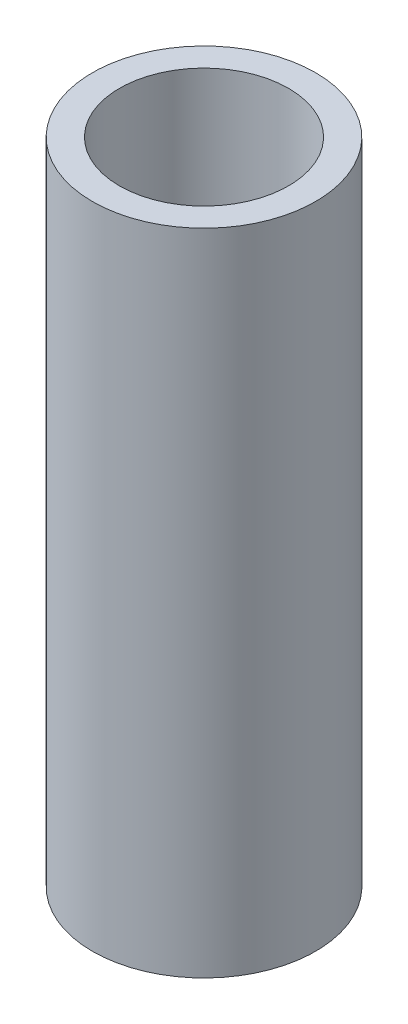
ISO-10303-21;
HEADER;
FILE_DESCRIPTION(('STEP AP214'),'2;1');
FILE_NAME('part.step','',(''),(''),'','','');
FILE_SCHEMA(('AUTOMOTIVE_DESIGN { 1 0 10303 214 1 1 1 1 }'));
ENDSEC;
DATA;
#1=APPLICATION_CONTEXT('core data for automotive mechanical design processes');
#2=APPLICATION_PROTOCOL_DEFINITION('international standard','automotive_design',2000,#1);
#3=PRODUCT_CONTEXT('',#1,'mechanical');
#4=PRODUCT('Part','Part','',(#3));
#5=PRODUCT_RELATED_PRODUCT_CATEGORY('part','',(#4));
#6=PRODUCT_DEFINITION_FORMATION('','',#4);
#7=PRODUCT_DEFINITION_CONTEXT('part definition',#1,'design');
#8=PRODUCT_DEFINITION('design','',#6,#7);
#9=PRODUCT_DEFINITION_SHAPE('','',#8);
#10=(LENGTH_UNIT() NAMED_UNIT(*) SI_UNIT(.MILLI.,.METRE.));
#11=(NAMED_UNIT(*) PLANE_ANGLE_UNIT() SI_UNIT($,.RADIAN.));
#12=(NAMED_UNIT(*) SI_UNIT($,.STERADIAN.) SOLID_ANGLE_UNIT());
#13=UNCERTAINTY_MEASURE_WITH_UNIT(LENGTH_MEASURE(1.E-05),#10,'distance_accuracy_value','');
#14=(GEOMETRIC_REPRESENTATION_CONTEXT(3) GLOBAL_UNCERTAINTY_ASSIGNED_CONTEXT((#13)) GLOBAL_UNIT_ASSIGNED_CONTEXT((#10,
#11,#12)) REPRESENTATION_CONTEXT('',''));
#15=CARTESIAN_POINT('',(0.,0.,0.));
#16=DIRECTION('',(0.,0.,1.));
#17=DIRECTION('',(1.,0.,0.));
#18=AXIS2_PLACEMENT_3D('',#15,#16,#17);
#19=CARTESIAN_POINT('',(0.,76.2,0.));
#20=DIRECTION('',(0.,1.,0.));
#21=DIRECTION('',(0.,0.,1.));
#22=AXIS2_PLACEMENT_3D('',#19,#20,#21);
#23=PLANE('',#22);
#24=CARTESIAN_POINT('',(0.,76.2,0.));
#25=DIRECTION('',(0.,1.,0.));
#26=DIRECTION('',(0.,0.,1.));
#27=AXIS2_PLACEMENT_3D('',#24,#25,#26);
#28=CIRCLE('',#27,13.096875);
#29=CARTESIAN_POINT('',(0.,76.2,13.096875));
#30=VERTEX_POINT('',#29);
#31=EDGE_CURVE('E10',#30,#30,#28,.T.);
#32=ORIENTED_EDGE('',*,*,#31,.T.);
#33=EDGE_LOOP('',(#32));
#34=FACE_BOUND('',#33,.T.);
#35=CARTESIAN_POINT('',(0.,76.2,0.));
#36=DIRECTION('',(0.,1.,0.));
#37=DIRECTION('',(0.,0.,1.));
#38=AXIS2_PLACEMENT_3D('',#35,#36,#37);
#39=CIRCLE('',#38,9.921875);
#40=CARTESIAN_POINT('',(0.,76.2,9.921875));
#41=VERTEX_POINT('',#40);
#42=EDGE_CURVE('E42',#41,#41,#39,.T.);
#43=ORIENTED_EDGE('',*,*,#42,.F.);
#44=EDGE_LOOP('',(#43));
#45=FACE_BOUND('',#44,.T.);
#46=ADVANCED_FACE('F31',(#34,#45),#23,.T.);
#47=CARTESIAN_POINT('',(0.,0.,0.));
#48=DIRECTION('',(0.,1.,0.));
#49=DIRECTION('',(0.,0.,1.));
#50=AXIS2_PLACEMENT_3D('',#47,#48,#49);
#51=PLANE('',#50);
#52=CARTESIAN_POINT('',(0.,0.,0.));
#53=DIRECTION('',(0.,1.,0.));
#54=DIRECTION('',(0.,0.,1.));
#55=AXIS2_PLACEMENT_3D('',#52,#53,#54);
#56=CIRCLE('',#55,13.096875);
#57=CARTESIAN_POINT('',(0.,0.,13.096875));
#58=VERTEX_POINT('',#57);
#59=EDGE_CURVE('E35',#58,#58,#56,.T.);
#60=ORIENTED_EDGE('',*,*,#59,.F.);
#61=EDGE_LOOP('',(#60));
#62=FACE_BOUND('',#61,.T.);
#63=CARTESIAN_POINT('',(0.,0.,0.));
#64=DIRECTION('',(0.,1.,0.));
#65=DIRECTION('',(0.,0.,1.));
#66=AXIS2_PLACEMENT_3D('',#63,#64,#65);
#67=CIRCLE('',#66,9.921875);
#68=CARTESIAN_POINT('',(0.,0.,9.921875));
#69=VERTEX_POINT('',#68);
#70=EDGE_CURVE('E44',#69,#69,#67,.T.);
#71=ORIENTED_EDGE('',*,*,#70,.T.);
#72=EDGE_LOOP('',(#71));
#73=FACE_BOUND('',#72,.T.);
#74=ADVANCED_FACE('F54',(#62,#73),#51,.F.);
#75=CARTESIAN_POINT('',(0.,76.2,0.));
#76=DIRECTION('',(0.,-1.,0.));
#77=DIRECTION('',(0.,0.,-1.));
#78=AXIS2_PLACEMENT_3D('',#75,#76,#77);
#79=CYLINDRICAL_SURFACE('',#78,13.096875);
#80=ORIENTED_EDGE('',*,*,#31,.F.);
#81=EDGE_LOOP('',(#80));
#82=FACE_BOUND('',#81,.T.);
#83=ORIENTED_EDGE('',*,*,#59,.T.);
#84=EDGE_LOOP('',(#83));
#85=FACE_BOUND('',#84,.T.);
#86=ADVANCED_FACE('F33',(#82,#85),#79,.T.);
#87=CARTESIAN_POINT('',(0.,76.2,0.));
#88=DIRECTION('',(0.,-1.,0.));
#89=DIRECTION('',(0.,0.,-1.));
#90=AXIS2_PLACEMENT_3D('',#87,#88,#89);
#91=CYLINDRICAL_SURFACE('',#90,9.921875);
#92=ORIENTED_EDGE('',*,*,#42,.T.);
#93=EDGE_LOOP('',(#92));
#94=FACE_BOUND('',#93,.T.);
#95=ORIENTED_EDGE('',*,*,#70,.F.);
#96=EDGE_LOOP('',(#95));
#97=FACE_BOUND('',#96,.T.);
#98=ADVANCED_FACE('F50',(#94,#97),#91,.F.);
#99=CLOSED_SHELL('',(#46,#74,#86,#98));
#100=MANIFOLD_SOLID_BREP('B2',#99);
#101=ADVANCED_BREP_SHAPE_REPRESENTATION('',(#18,#100),#14);
#102=SHAPE_DEFINITION_REPRESENTATION(#9,#101);
ENDSEC;
END-ISO-10303-21;
